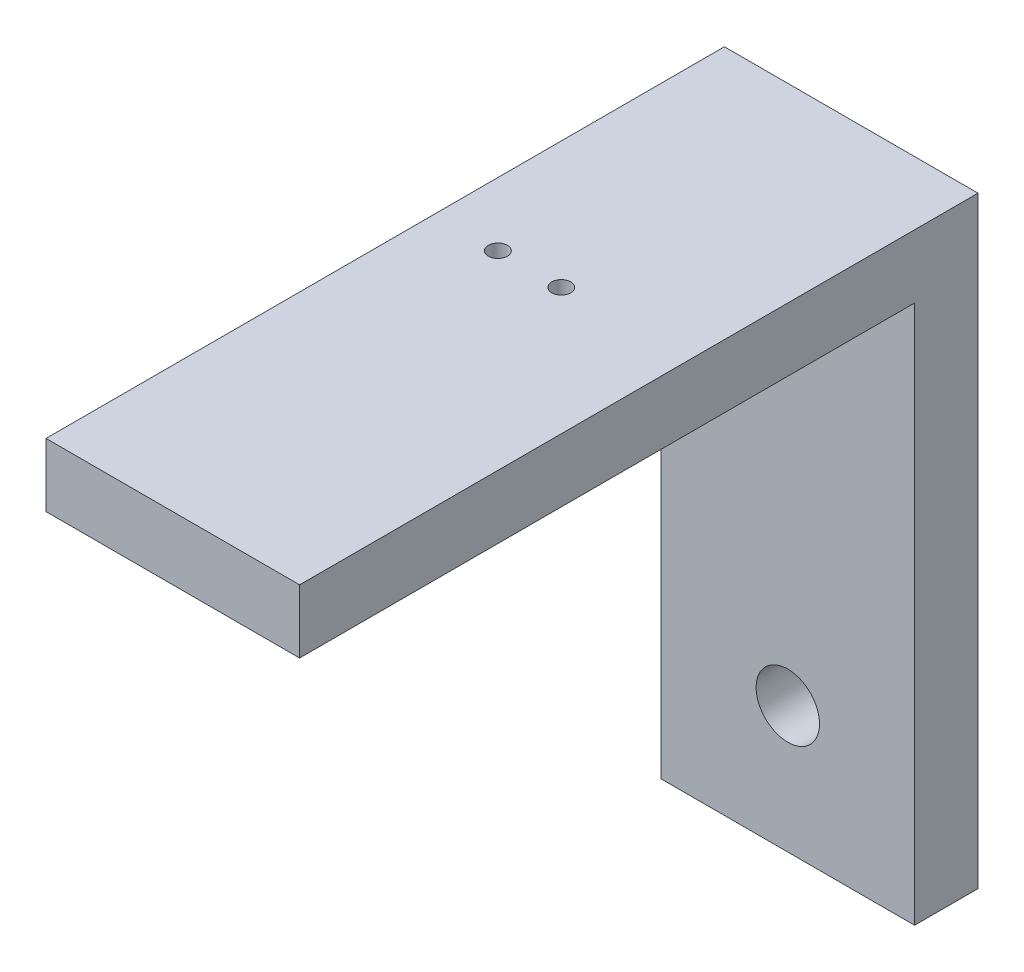
ISO-10303-21;
HEADER;
FILE_DESCRIPTION(('STEP AP214'),'2;1');
FILE_NAME('part.step','',(''),(''),'','','');
FILE_SCHEMA(('AUTOMOTIVE_DESIGN { 1 0 10303 214 1 1 1 1 }'));
ENDSEC;
DATA;
#1=APPLICATION_CONTEXT('core data for automotive mechanical design processes');
#2=APPLICATION_PROTOCOL_DEFINITION('international standard','automotive_design',2000,#1);
#3=PRODUCT_CONTEXT('',#1,'mechanical');
#4=PRODUCT('Part','Part','',(#3));
#5=PRODUCT_RELATED_PRODUCT_CATEGORY('part','',(#4));
#6=PRODUCT_DEFINITION_FORMATION('','',#4);
#7=PRODUCT_DEFINITION_CONTEXT('part definition',#1,'design');
#8=PRODUCT_DEFINITION('design','',#6,#7);
#9=PRODUCT_DEFINITION_SHAPE('','',#8);
#10=(LENGTH_UNIT() NAMED_UNIT(*) SI_UNIT(.MILLI.,.METRE.));
#11=(NAMED_UNIT(*) PLANE_ANGLE_UNIT() SI_UNIT($,.RADIAN.));
#12=(NAMED_UNIT(*) SI_UNIT($,.STERADIAN.) SOLID_ANGLE_UNIT());
#13=UNCERTAINTY_MEASURE_WITH_UNIT(LENGTH_MEASURE(1.E-05),#10,'distance_accuracy_value','');
#14=(GEOMETRIC_REPRESENTATION_CONTEXT(3) GLOBAL_UNCERTAINTY_ASSIGNED_CONTEXT((#13)) GLOBAL_UNIT_ASSIGNED_CONTEXT((#10,
#11,#12)) REPRESENTATION_CONTEXT('',''));
#15=CARTESIAN_POINT('',(0.,0.,0.));
#16=DIRECTION('',(0.,0.,1.));
#17=DIRECTION('',(1.,0.,0.));
#18=AXIS2_PLACEMENT_3D('',#15,#16,#17);
#19=CARTESIAN_POINT('',(-20.,-20.,10.));
#20=DIRECTION('',(0.,1.,0.));
#21=DIRECTION('',(0.,0.,1.));
#22=AXIS2_PLACEMENT_3D('',#19,#20,#21);
#23=PLANE('',#22);
#24=DIRECTION('',(1.,0.,0.));
#25=VECTOR('',#24,1.);
#26=CARTESIAN_POINT('',(-20.,-20.,0.));
#27=LINE('',#26,#25);
#28=CARTESIAN_POINT('',(-20.,-20.,0.));
#29=VERTEX_POINT('',#28);
#30=CARTESIAN_POINT('',(20.,-20.,0.));
#31=VERTEX_POINT('',#30);
#32=EDGE_CURVE('E94',#29,#31,#27,.T.);
#33=ORIENTED_EDGE('',*,*,#32,.T.);
#34=DIRECTION('',(0.,0.,-1.));
#35=VECTOR('',#34,1.);
#36=CARTESIAN_POINT('',(20.,-20.,10.));
#37=LINE('',#36,#35);
#38=CARTESIAN_POINT('',(20.,-20.,10.));
#39=VERTEX_POINT('',#38);
#40=EDGE_CURVE('E11',#39,#31,#37,.T.);
#41=ORIENTED_EDGE('',*,*,#40,.F.);
#42=DIRECTION('',(1.,0.,0.));
#43=VECTOR('',#42,1.);
#44=CARTESIAN_POINT('',(-20.,-20.,10.));
#45=LINE('',#44,#43);
#46=CARTESIAN_POINT('',(-20.,-20.,10.));
#47=VERTEX_POINT('',#46);
#48=EDGE_CURVE('E88',#47,#39,#45,.T.);
#49=ORIENTED_EDGE('',*,*,#48,.F.);
#50=DIRECTION('',(0.,0.,-1.));
#51=VECTOR('',#50,1.);
#52=CARTESIAN_POINT('',(-20.,-20.,10.));
#53=LINE('',#52,#51);
#54=EDGE_CURVE('E50',#47,#29,#53,.T.);
#55=ORIENTED_EDGE('',*,*,#54,.T.);
#56=EDGE_LOOP('',(#33,#41,#49,#55));
#57=FACE_BOUND('',#56,.T.);
#58=ADVANCED_FACE('F41',(#57),#23,.F.);
#59=CARTESIAN_POINT('',(20.,-20.,10.));
#60=DIRECTION('',(-1.,0.,0.));
#61=DIRECTION('',(0.,-1.,0.));
#62=AXIS2_PLACEMENT_3D('',#59,#60,#61);
#63=PLANE('',#62);
#64=DIRECTION('',(0.,1.,0.));
#65=VECTOR('',#64,1.);
#66=CARTESIAN_POINT('',(20.,-20.,0.));
#67=LINE('',#66,#65);
#68=CARTESIAN_POINT('',(20.,75.,0.));
#69=VERTEX_POINT('',#68);
#70=EDGE_CURVE('E89',#31,#69,#67,.T.);
#71=ORIENTED_EDGE('',*,*,#70,.T.);
#72=DIRECTION('',(0.,0.,1.));
#73=VECTOR('',#72,1.);
#74=CARTESIAN_POINT('',(20.,75.,0.));
#75=LINE('',#74,#73);
#76=CARTESIAN_POINT('',(20.,75.,107.));
#77=VERTEX_POINT('',#76);
#78=EDGE_CURVE('E164',#69,#77,#75,.T.);
#79=ORIENTED_EDGE('',*,*,#78,.T.);
#80=DIRECTION('',(0.,-1.,0.));
#81=VECTOR('',#80,1.);
#82=CARTESIAN_POINT('',(20.,75.,107.));
#83=LINE('',#82,#81);
#84=CARTESIAN_POINT('',(20.,65.,107.));
#85=VERTEX_POINT('',#84);
#86=EDGE_CURVE('E150',#77,#85,#83,.T.);
#87=ORIENTED_EDGE('',*,*,#86,.T.);
#88=DIRECTION('',(0.,0.,-1.));
#89=VECTOR('',#88,1.);
#90=CARTESIAN_POINT('',(20.,65.,107.));
#91=LINE('',#90,#89);
#92=CARTESIAN_POINT('',(20.,65.,10.));
#93=VERTEX_POINT('',#92);
#94=EDGE_CURVE('E156',#85,#93,#91,.T.);
#95=ORIENTED_EDGE('',*,*,#94,.T.);
#96=DIRECTION('',(0.,1.,0.));
#97=VECTOR('',#96,1.);
#98=CARTESIAN_POINT('',(20.,-20.,10.));
#99=LINE('',#98,#97);
#100=EDGE_CURVE('E171',#39,#93,#99,.T.);
#101=ORIENTED_EDGE('',*,*,#100,.F.);
#102=ORIENTED_EDGE('',*,*,#40,.T.);
#103=EDGE_LOOP('',(#71,#79,#87,#95,#101,#102));
#104=FACE_BOUND('',#103,.T.);
#105=ADVANCED_FACE('F179',(#104),#63,.F.);
#106=CARTESIAN_POINT('',(-20.,20.,10.));
#107=DIRECTION('',(1.,0.,0.));
#108=DIRECTION('',(0.,0.,-1.));
#109=AXIS2_PLACEMENT_3D('',#106,#107,#108);
#110=PLANE('',#109);
#111=DIRECTION('',(0.,-1.,0.));
#112=VECTOR('',#111,1.);
#113=CARTESIAN_POINT('',(-20.,20.,0.));
#114=LINE('',#113,#112);
#115=CARTESIAN_POINT('',(-20.,75.,0.));
#116=VERTEX_POINT('',#115);
#117=EDGE_CURVE('E77',#116,#29,#114,.T.);
#118=ORIENTED_EDGE('',*,*,#117,.T.);
#119=ORIENTED_EDGE('',*,*,#54,.F.);
#120=DIRECTION('',(0.,-1.,0.));
#121=VECTOR('',#120,1.);
#122=CARTESIAN_POINT('',(-20.,20.,10.));
#123=LINE('',#122,#121);
#124=CARTESIAN_POINT('',(-20.,65.,10.));
#125=VERTEX_POINT('',#124);
#126=EDGE_CURVE('E63',#125,#47,#123,.T.);
#127=ORIENTED_EDGE('',*,*,#126,.F.);
#128=DIRECTION('',(0.,0.,-1.));
#129=VECTOR('',#128,1.);
#130=CARTESIAN_POINT('',(-20.,65.,107.));
#131=LINE('',#130,#129);
#132=CARTESIAN_POINT('',(-20.,65.,107.));
#133=VERTEX_POINT('',#132);
#134=EDGE_CURVE('E160',#133,#125,#131,.T.);
#135=ORIENTED_EDGE('',*,*,#134,.F.);
#136=DIRECTION('',(0.,-1.,0.));
#137=VECTOR('',#136,1.);
#138=CARTESIAN_POINT('',(-20.,75.,107.));
#139=LINE('',#138,#137);
#140=CARTESIAN_POINT('',(-20.,75.,107.));
#141=VERTEX_POINT('',#140);
#142=EDGE_CURVE('E144',#141,#133,#139,.T.);
#143=ORIENTED_EDGE('',*,*,#142,.F.);
#144=DIRECTION('',(0.,0.,1.));
#145=VECTOR('',#144,1.);
#146=CARTESIAN_POINT('',(-20.,75.,0.));
#147=LINE('',#146,#145);
#148=EDGE_CURVE('E83',#116,#141,#147,.T.);
#149=ORIENTED_EDGE('',*,*,#148,.F.);
#150=EDGE_LOOP('',(#118,#119,#127,#135,#143,#149));
#151=FACE_BOUND('',#150,.T.);
#152=ADVANCED_FACE('F79',(#151),#110,.F.);
#153=CARTESIAN_POINT('',(0.,0.,10.));
#154=DIRECTION('',(0.,0.,1.));
#155=DIRECTION('',(1.,0.,0.));
#156=AXIS2_PLACEMENT_3D('',#153,#154,#155);
#157=PLANE('',#156);
#158=DIRECTION('',(1.,0.,0.));
#159=VECTOR('',#158,1.);
#160=CARTESIAN_POINT('',(-20.,65.,10.));
#161=LINE('',#160,#159);
#162=EDGE_CURVE('E58',#125,#93,#161,.T.);
#163=ORIENTED_EDGE('',*,*,#162,.F.);
#164=ORIENTED_EDGE('',*,*,#126,.T.);
#165=ORIENTED_EDGE('',*,*,#48,.T.);
#166=ORIENTED_EDGE('',*,*,#100,.T.);
#167=EDGE_LOOP('',(#163,#164,#165,#166));
#168=FACE_BOUND('',#167,.T.);
#169=CARTESIAN_POINT('',(0.,0.,10.));
#170=DIRECTION('',(0.,0.,1.));
#171=DIRECTION('',(1.,0.,0.));
#172=AXIS2_PLACEMENT_3D('',#169,#170,#171);
#173=CIRCLE('',#172,5.);
#174=CARTESIAN_POINT('',(5.,0.,10.));
#175=VERTEX_POINT('',#174);
#176=EDGE_CURVE('E98',#175,#175,#173,.F.);
#177=ORIENTED_EDGE('',*,*,#176,.T.);
#178=EDGE_LOOP('',(#177));
#179=FACE_BOUND('',#178,.T.);
#180=ADVANCED_FACE('F173',(#168,#179),#157,.T.);
#181=CARTESIAN_POINT('',(0.,0.,0.));
#182=DIRECTION('',(0.,0.,1.));
#183=DIRECTION('',(1.,0.,0.));
#184=AXIS2_PLACEMENT_3D('',#181,#182,#183);
#185=PLANE('',#184);
#186=CARTESIAN_POINT('',(-10.3794306259891,-1.08718765015373E-13,0.));
#187=DIRECTION('',(0.,0.,1.));
#188=DIRECTION('',(1.,0.,0.));
#189=AXIS2_PLACEMENT_3D('',#186,#187,#188);
#190=CIRCLE('',#189,1.53589838486225);
#191=CARTESIAN_POINT('',(-8.84353224112681,-1.08718765015373E-13,0.));
#192=VERTEX_POINT('',#191);
#193=EDGE_CURVE('E45',#192,#192,#190,.T.);
#194=ORIENTED_EDGE('',*,*,#193,.T.);
#195=EDGE_LOOP('',(#194));
#196=FACE_BOUND('',#195,.T.);
#197=CARTESIAN_POINT('',(0.,10.3794306259891,0.));
#198=DIRECTION('',(0.,0.,1.));
#199=DIRECTION('',(1.,0.,0.));
#200=AXIS2_PLACEMENT_3D('',#197,#198,#199);
#201=CIRCLE('',#200,1.53589838486225);
#202=CARTESIAN_POINT('',(1.53589838486225,10.3794306259891,0.));
#203=VERTEX_POINT('',#202);
#204=EDGE_CURVE('E123',#203,#203,#201,.T.);
#205=ORIENTED_EDGE('',*,*,#204,.T.);
#206=EDGE_LOOP('',(#205));
#207=FACE_BOUND('',#206,.T.);
#208=CARTESIAN_POINT('',(10.3794306259891,0.,0.));
#209=DIRECTION('',(0.,0.,1.));
#210=DIRECTION('',(1.,0.,0.));
#211=AXIS2_PLACEMENT_3D('',#208,#209,#210);
#212=CIRCLE('',#211,1.53589838486225);
#213=CARTESIAN_POINT('',(11.9153290108513,0.,0.));
#214=VERTEX_POINT('',#213);
#215=EDGE_CURVE('E120',#214,#214,#212,.T.);
#216=ORIENTED_EDGE('',*,*,#215,.T.);
#217=EDGE_LOOP('',(#216));
#218=FACE_BOUND('',#217,.T.);
#219=CARTESIAN_POINT('',(0.,-10.3794306259891,0.));
#220=DIRECTION('',(0.,0.,1.));
#221=DIRECTION('',(1.,0.,0.));
#222=AXIS2_PLACEMENT_3D('',#219,#220,#221);
#223=CIRCLE('',#222,1.53589838486225);
#224=CARTESIAN_POINT('',(1.53589838486225,-10.3794306259891,0.));
#225=VERTEX_POINT('',#224);
#226=EDGE_CURVE('E115',#225,#225,#223,.T.);
#227=ORIENTED_EDGE('',*,*,#226,.T.);
#228=EDGE_LOOP('',(#227));
#229=FACE_BOUND('',#228,.T.);
#230=CARTESIAN_POINT('',(0.,0.,0.));
#231=DIRECTION('',(0.,0.,1.));
#232=DIRECTION('',(1.,0.,0.));
#233=AXIS2_PLACEMENT_3D('',#230,#231,#232);
#234=CIRCLE('',#233,5.);
#235=CARTESIAN_POINT('',(5.,0.,0.));
#236=VERTEX_POINT('',#235);
#237=EDGE_CURVE('E102',#236,#236,#234,.T.);
#238=ORIENTED_EDGE('',*,*,#237,.T.);
#239=EDGE_LOOP('',(#238));
#240=FACE_BOUND('',#239,.T.);
#241=ORIENTED_EDGE('',*,*,#32,.F.);
#242=ORIENTED_EDGE('',*,*,#117,.F.);
#243=DIRECTION('',(1.,0.,0.));
#244=VECTOR('',#243,1.);
#245=CARTESIAN_POINT('',(-20.,75.,0.));
#246=LINE('',#245,#244);
#247=EDGE_CURVE('E167',#116,#69,#246,.T.);
#248=ORIENTED_EDGE('',*,*,#247,.T.);
#249=ORIENTED_EDGE('',*,*,#70,.F.);
#250=EDGE_LOOP('',(#241,#242,#248,#249));
#251=FACE_BOUND('',#250,.T.);
#252=ADVANCED_FACE('F96',(#196,#207,#218,#229,#240,#251),#185,.F.);
#253=CARTESIAN_POINT('',(0.,0.,19.));
#254=DIRECTION('',(0.,0.,-1.));
#255=DIRECTION('',(-1.,0.,0.));
#256=AXIS2_PLACEMENT_3D('',#253,#254,#255);
#257=CYLINDRICAL_SURFACE('',#256,5.);
#258=ORIENTED_EDGE('',*,*,#176,.F.);
#259=EDGE_LOOP('',(#258));
#260=FACE_BOUND('',#259,.T.);
#261=ORIENTED_EDGE('',*,*,#237,.F.);
#262=EDGE_LOOP('',(#261));
#263=FACE_BOUND('',#262,.T.);
#264=ADVANCED_FACE('F264',(#260,#263),#257,.F.);
#265=CARTESIAN_POINT('',(0.,75.,0.));
#266=DIRECTION('',(0.,1.,0.));
#267=DIRECTION('',(-1.,0.,0.));
#268=AXIS2_PLACEMENT_3D('',#265,#266,#267);
#269=PLANE('',#268);
#270=CARTESIAN_POINT('',(-10.,75.,45.7294056375897));
#271=DIRECTION('',(0.,1.,0.));
#272=DIRECTION('',(-1.,0.,0.));
#273=AXIS2_PLACEMENT_3D('',#270,#271,#272);
#274=CIRCLE('',#273,1.5);
#275=CARTESIAN_POINT('',(-11.5,75.,45.7294056375897));
#276=VERTEX_POINT('',#275);
#277=EDGE_CURVE('E114',#276,#276,#274,.T.);
#278=ORIENTED_EDGE('',*,*,#277,.F.);
#279=EDGE_LOOP('',(#278));
#280=FACE_BOUND('',#279,.T.);
#281=CARTESIAN_POINT('',(0.,75.,45.7294056375897));
#282=DIRECTION('',(0.,1.,0.));
#283=DIRECTION('',(-1.,0.,0.));
#284=AXIS2_PLACEMENT_3D('',#281,#282,#283);
#285=CIRCLE('',#284,1.5);
#286=CARTESIAN_POINT('',(-1.50000000000001,75.,45.7294056375897));
#287=VERTEX_POINT('',#286);
#288=EDGE_CURVE('E110',#287,#287,#285,.T.);
#289=ORIENTED_EDGE('',*,*,#288,.F.);
#290=EDGE_LOOP('',(#289));
#291=FACE_BOUND('',#290,.T.);
#292=ORIENTED_EDGE('',*,*,#148,.T.);
#293=DIRECTION('',(1.,0.,0.));
#294=VECTOR('',#293,1.);
#295=CARTESIAN_POINT('',(-20.,75.,107.));
#296=LINE('',#295,#294);
#297=EDGE_CURVE('E153',#141,#77,#296,.T.);
#298=ORIENTED_EDGE('',*,*,#297,.T.);
#299=ORIENTED_EDGE('',*,*,#78,.F.);
#300=ORIENTED_EDGE('',*,*,#247,.F.);
#301=EDGE_LOOP('',(#292,#298,#299,#300));
#302=FACE_BOUND('',#301,.T.);
#303=ADVANCED_FACE('F197',(#280,#291,#302),#269,.T.);
#304=CARTESIAN_POINT('',(-20.,65.,107.));
#305=DIRECTION('',(0.,1.,0.));
#306=DIRECTION('',(0.,0.,1.));
#307=AXIS2_PLACEMENT_3D('',#304,#305,#306);
#308=PLANE('',#307);
#309=CARTESIAN_POINT('',(-10.,65.,45.7294056375897));
#310=DIRECTION('',(0.,1.,0.));
#311=DIRECTION('',(0.,0.,1.));
#312=AXIS2_PLACEMENT_3D('',#309,#310,#311);
#313=CIRCLE('',#312,1.5);
#314=CARTESIAN_POINT('',(-10.,65.,47.2294056375897));
#315=VERTEX_POINT('',#314);
#316=EDGE_CURVE('E111',#315,#315,#313,.T.);
#317=ORIENTED_EDGE('',*,*,#316,.T.);
#318=EDGE_LOOP('',(#317));
#319=FACE_BOUND('',#318,.T.);
#320=CARTESIAN_POINT('',(0.,65.,45.7294056375897));
#321=DIRECTION('',(0.,1.,0.));
#322=DIRECTION('',(0.,0.,1.));
#323=AXIS2_PLACEMENT_3D('',#320,#321,#322);
#324=CIRCLE('',#323,1.5);
#325=CARTESIAN_POINT('',(0.,65.,47.2294056375897));
#326=VERTEX_POINT('',#325);
#327=EDGE_CURVE('E107',#326,#326,#324,.T.);
#328=ORIENTED_EDGE('',*,*,#327,.T.);
#329=EDGE_LOOP('',(#328));
#330=FACE_BOUND('',#329,.T.);
#331=ORIENTED_EDGE('',*,*,#162,.T.);
#332=ORIENTED_EDGE('',*,*,#94,.F.);
#333=DIRECTION('',(1.,0.,0.));
#334=VECTOR('',#333,1.);
#335=CARTESIAN_POINT('',(-20.,65.,107.));
#336=LINE('',#335,#334);
#337=EDGE_CURVE('E147',#133,#85,#336,.T.);
#338=ORIENTED_EDGE('',*,*,#337,.F.);
#339=ORIENTED_EDGE('',*,*,#134,.T.);
#340=EDGE_LOOP('',(#331,#332,#338,#339));
#341=FACE_BOUND('',#340,.T.);
#342=ADVANCED_FACE('F184',(#319,#330,#341),#308,.F.);
#343=CARTESIAN_POINT('',(0.,0.,107.));
#344=DIRECTION('',(0.,0.,1.));
#345=DIRECTION('',(1.,0.,0.));
#346=AXIS2_PLACEMENT_3D('',#343,#344,#345);
#347=PLANE('',#346);
#348=ORIENTED_EDGE('',*,*,#142,.T.);
#349=ORIENTED_EDGE('',*,*,#337,.T.);
#350=ORIENTED_EDGE('',*,*,#86,.F.);
#351=ORIENTED_EDGE('',*,*,#297,.F.);
#352=EDGE_LOOP('',(#348,#349,#350,#351));
#353=FACE_BOUND('',#352,.T.);
#354=ADVANCED_FACE('F199',(#353),#347,.T.);
#355=CARTESIAN_POINT('',(0.,58.,45.7294056375897));
#356=DIRECTION('',(0.,1.,0.));
#357=DIRECTION('',(-1.,0.,0.));
#358=AXIS2_PLACEMENT_3D('',#355,#356,#357);
#359=CYLINDRICAL_SURFACE('',#358,1.5);
#360=ORIENTED_EDGE('',*,*,#288,.T.);
#361=EDGE_LOOP('',(#360));
#362=FACE_BOUND('',#361,.T.);
#363=ORIENTED_EDGE('',*,*,#327,.F.);
#364=EDGE_LOOP('',(#363));
#365=FACE_BOUND('',#364,.T.);
#366=ADVANCED_FACE('F201',(#362,#365),#359,.F.);
#367=CARTESIAN_POINT('',(-10.,58.,45.7294056375897));
#368=DIRECTION('',(0.,1.,0.));
#369=DIRECTION('',(-1.,0.,0.));
#370=AXIS2_PLACEMENT_3D('',#367,#368,#369);
#371=CYLINDRICAL_SURFACE('',#370,1.5);
#372=ORIENTED_EDGE('',*,*,#277,.T.);
#373=EDGE_LOOP('',(#372));
#374=FACE_BOUND('',#373,.T.);
#375=ORIENTED_EDGE('',*,*,#316,.F.);
#376=EDGE_LOOP('',(#375));
#377=FACE_BOUND('',#376,.T.);
#378=ADVANCED_FACE('F207',(#374,#377),#371,.F.);
#379=CARTESIAN_POINT('',(0.,-10.3794306259891,-2.));
#380=DIRECTION('',(0.,0.,1.));
#381=DIRECTION('',(1.,0.,0.));
#382=AXIS2_PLACEMENT_3D('',#379,#380,#381);
#383=CONICAL_SURFACE('',#382,1.,0.26179938779915);
#384=CARTESIAN_POINT('',(0.,-10.3794306259891,-2.));
#385=DIRECTION('',(0.,0.,1.));
#386=DIRECTION('',(1.,0.,0.));
#387=AXIS2_PLACEMENT_3D('',#384,#385,#386);
#388=CIRCLE('',#387,1.);
#389=CARTESIAN_POINT('',(1.,-10.3794306259891,-2.));
#390=VERTEX_POINT('',#389);
#391=EDGE_CURVE('E118',#390,#390,#388,.T.);
#392=ORIENTED_EDGE('',*,*,#391,.T.);
#393=EDGE_LOOP('',(#392));
#394=FACE_BOUND('',#393,.T.);
#395=ORIENTED_EDGE('',*,*,#226,.F.);
#396=EDGE_LOOP('',(#395));
#397=FACE_BOUND('',#396,.T.);
#398=ADVANCED_FACE('F220',(#394,#397),#383,.T.);
#399=CARTESIAN_POINT('',(0.,-10.3794306259891,-2.));
#400=DIRECTION('',(0.,0.,1.));
#401=DIRECTION('',(1.,0.,0.));
#402=AXIS2_PLACEMENT_3D('',#399,#400,#401);
#403=PLANE('',#402);
#404=ORIENTED_EDGE('',*,*,#391,.F.);
#405=EDGE_LOOP('',(#404));
#406=FACE_BOUND('',#405,.T.);
#407=ADVANCED_FACE('F223',(#406),#403,.F.);
#408=CARTESIAN_POINT('',(10.3794306259891,0.,-2.));
#409=DIRECTION('',(0.,0.,1.));
#410=DIRECTION('',(0.,1.,0.));
#411=AXIS2_PLACEMENT_3D('',#408,#409,#410);
#412=CONICAL_SURFACE('',#411,1.,0.26179938779915);
#413=CARTESIAN_POINT('',(10.3794306259891,0.,-2.));
#414=DIRECTION('',(0.,0.,1.));
#415=DIRECTION('',(0.,1.,0.));
#416=AXIS2_PLACEMENT_3D('',#413,#414,#415);
#417=CIRCLE('',#416,1.);
#418=CARTESIAN_POINT('',(10.3794306259891,1.00000000000004,-2.));
#419=VERTEX_POINT('',#418);
#420=EDGE_CURVE('E119',#419,#419,#417,.T.);
#421=ORIENTED_EDGE('',*,*,#420,.T.);
#422=EDGE_LOOP('',(#421));
#423=FACE_BOUND('',#422,.T.);
#424=ORIENTED_EDGE('',*,*,#215,.F.);
#425=EDGE_LOOP('',(#424));
#426=FACE_BOUND('',#425,.T.);
#427=ADVANCED_FACE('F225',(#423,#426),#412,.T.);
#428=CARTESIAN_POINT('',(10.3794306259891,0.,-2.));
#429=DIRECTION('',(0.,0.,1.));
#430=DIRECTION('',(0.,1.,0.));
#431=AXIS2_PLACEMENT_3D('',#428,#429,#430);
#432=PLANE('',#431);
#433=ORIENTED_EDGE('',*,*,#420,.F.);
#434=EDGE_LOOP('',(#433));
#435=FACE_BOUND('',#434,.T.);
#436=ADVANCED_FACE('F227',(#435),#432,.F.);
#437=CARTESIAN_POINT('',(0.,10.3794306259891,-2.));
#438=DIRECTION('',(0.,0.,1.));
#439=DIRECTION('',(-1.,0.,0.));
#440=AXIS2_PLACEMENT_3D('',#437,#438,#439);
#441=CONICAL_SURFACE('',#440,1.,0.26179938779915);
#442=CARTESIAN_POINT('',(0.,10.3794306259891,-2.));
#443=DIRECTION('',(0.,0.,1.));
#444=DIRECTION('',(-1.,0.,0.));
#445=AXIS2_PLACEMENT_3D('',#442,#443,#444);
#446=CIRCLE('',#445,1.);
#447=CARTESIAN_POINT('',(-1.,10.3794306259891,-2.));
#448=VERTEX_POINT('',#447);
#449=EDGE_CURVE('E122',#448,#448,#446,.T.);
#450=ORIENTED_EDGE('',*,*,#449,.T.);
#451=EDGE_LOOP('',(#450));
#452=FACE_BOUND('',#451,.T.);
#453=ORIENTED_EDGE('',*,*,#204,.F.);
#454=EDGE_LOOP('',(#453));
#455=FACE_BOUND('',#454,.T.);
#456=ADVANCED_FACE('F229',(#452,#455),#441,.T.);
#457=CARTESIAN_POINT('',(0.,10.3794306259891,-2.));
#458=DIRECTION('',(0.,0.,1.));
#459=DIRECTION('',(-1.,0.,0.));
#460=AXIS2_PLACEMENT_3D('',#457,#458,#459);
#461=PLANE('',#460);
#462=ORIENTED_EDGE('',*,*,#449,.F.);
#463=EDGE_LOOP('',(#462));
#464=FACE_BOUND('',#463,.T.);
#465=ADVANCED_FACE('F231',(#464),#461,.F.);
#466=CARTESIAN_POINT('',(-10.3794306259891,-1.08718765015373E-13,-2.));
#467=DIRECTION('',(0.,0.,1.));
#468=DIRECTION('',(0.,-1.,0.));
#469=AXIS2_PLACEMENT_3D('',#466,#467,#468);
#470=CONICAL_SURFACE('',#469,1.,0.26179938779915);
#471=CARTESIAN_POINT('',(-10.3794306259891,-1.08718765015373E-13,-2.));
#472=DIRECTION('',(0.,0.,1.));
#473=DIRECTION('',(0.,-1.,0.));
#474=AXIS2_PLACEMENT_3D('',#471,#472,#473);
#475=CIRCLE('',#474,1.);
#476=CARTESIAN_POINT('',(-10.379430625989,-1.00000000000011,-2.));
#477=VERTEX_POINT('',#476);
#478=EDGE_CURVE('E125',#477,#477,#475,.T.);
#479=ORIENTED_EDGE('',*,*,#478,.T.);
#480=EDGE_LOOP('',(#479));
#481=FACE_BOUND('',#480,.T.);
#482=ORIENTED_EDGE('',*,*,#193,.F.);
#483=EDGE_LOOP('',(#482));
#484=FACE_BOUND('',#483,.T.);
#485=ADVANCED_FACE('F43',(#481,#484),#470,.T.);
#486=CARTESIAN_POINT('',(-10.3794306259891,-1.08718765015373E-13,-2.));
#487=DIRECTION('',(0.,0.,1.));
#488=DIRECTION('',(0.,-1.,0.));
#489=AXIS2_PLACEMENT_3D('',#486,#487,#488);
#490=PLANE('',#489);
#491=ORIENTED_EDGE('',*,*,#478,.F.);
#492=EDGE_LOOP('',(#491));
#493=FACE_BOUND('',#492,.T.);
#494=ADVANCED_FACE('F375',(#493),#490,.F.);
#495=CLOSED_SHELL('',(#58,#105,#152,#180,#252,#264,#303,#342,#354,#366,#378,#398,#407,#427,#436,
#456,#465,#485,#494));
#496=MANIFOLD_SOLID_BREP('B2',#495);
#497=ADVANCED_BREP_SHAPE_REPRESENTATION('',(#18,#496),#14);
#498=SHAPE_DEFINITION_REPRESENTATION(#9,#497);
ENDSEC;
END-ISO-10303-21;
